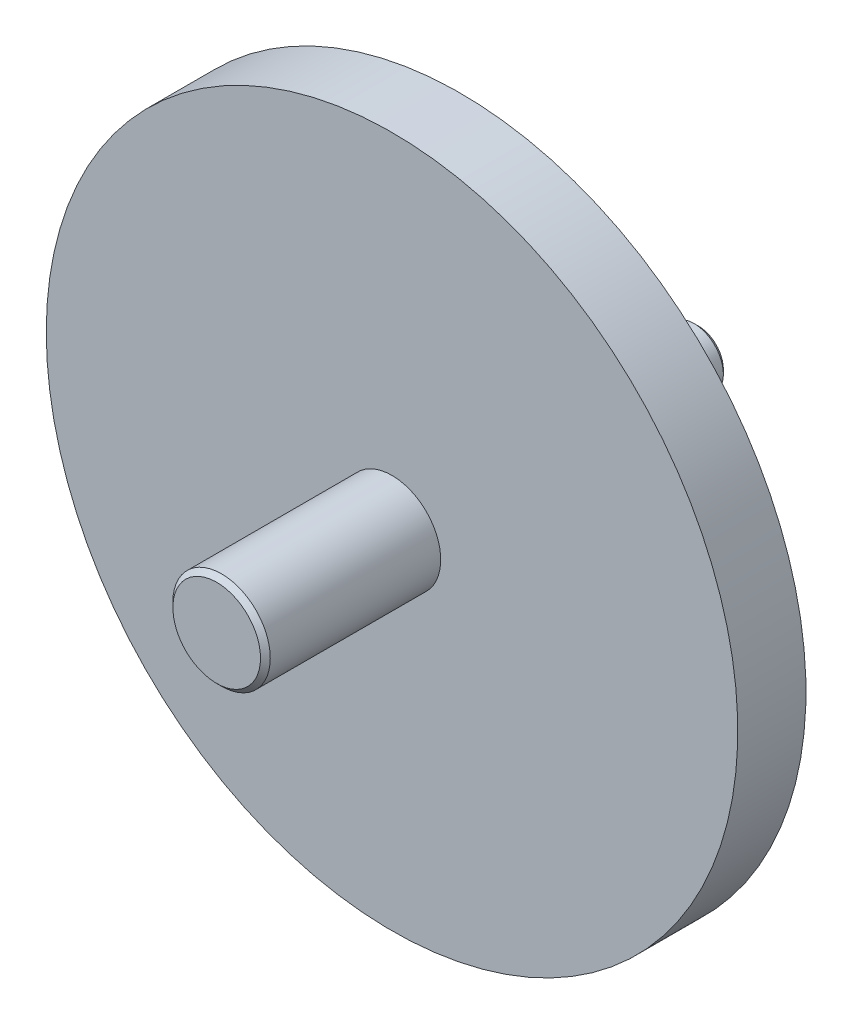
ISO-10303-21;
HEADER;
FILE_DESCRIPTION(('STEP AP214'),'2;1');
FILE_NAME('part.step','',(''),(''),'','','');
FILE_SCHEMA(('AUTOMOTIVE_DESIGN { 1 0 10303 214 1 1 1 1 }'));
ENDSEC;
DATA;
#1=APPLICATION_CONTEXT('core data for automotive mechanical design processes');
#2=APPLICATION_PROTOCOL_DEFINITION('international standard','automotive_design',2000,#1);
#3=PRODUCT_CONTEXT('',#1,'mechanical');
#4=PRODUCT('Part','Part','',(#3));
#5=PRODUCT_RELATED_PRODUCT_CATEGORY('part','',(#4));
#6=PRODUCT_DEFINITION_FORMATION('','',#4);
#7=PRODUCT_DEFINITION_CONTEXT('part definition',#1,'design');
#8=PRODUCT_DEFINITION('design','',#6,#7);
#9=PRODUCT_DEFINITION_SHAPE('','',#8);
#10=(LENGTH_UNIT() NAMED_UNIT(*) SI_UNIT(.MILLI.,.METRE.));
#11=(NAMED_UNIT(*) PLANE_ANGLE_UNIT() SI_UNIT($,.RADIAN.));
#12=(NAMED_UNIT(*) SI_UNIT($,.STERADIAN.) SOLID_ANGLE_UNIT());
#13=UNCERTAINTY_MEASURE_WITH_UNIT(LENGTH_MEASURE(1.E-05),#10,'distance_accuracy_value','');
#14=(GEOMETRIC_REPRESENTATION_CONTEXT(3) GLOBAL_UNCERTAINTY_ASSIGNED_CONTEXT((#13)) GLOBAL_UNIT_ASSIGNED_CONTEXT((#10,
#11,#12)) REPRESENTATION_CONTEXT('',''));
#15=CARTESIAN_POINT('',(0.,0.,0.));
#16=DIRECTION('',(0.,0.,1.));
#17=DIRECTION('',(1.,0.,0.));
#18=AXIS2_PLACEMENT_3D('',#15,#16,#17);
#19=CARTESIAN_POINT('',(0.,3.,-49.4641016151376));
#20=DIRECTION('',(0.,0.,-1.));
#21=DIRECTION('',(-1.,0.,0.));
#22=AXIS2_PLACEMENT_3D('',#19,#20,#21);
#23=PLANE('',#22);
#24=CARTESIAN_POINT('',(0.,0.,-49.4641016151376));
#25=DIRECTION('',(0.,0.,-1.));
#26=DIRECTION('',(-1.,0.,0.));
#27=AXIS2_PLACEMENT_3D('',#24,#25,#26);
#28=CIRCLE('',#27,2.55);
#29=CARTESIAN_POINT('',(-2.55,0.,-49.4641016151376));
#30=VERTEX_POINT('',#29);
#31=EDGE_CURVE('E68',#30,#30,#28,.T.);
#32=ORIENTED_EDGE('',*,*,#31,.T.);
#33=EDGE_LOOP('',(#32));
#34=FACE_BOUND('',#33,.T.);
#35=ADVANCED_FACE('F47',(#34),#23,.T.);
#36=CARTESIAN_POINT('',(0.,0.,-49.4641016151376));
#37=DIRECTION('',(0.,0.,-1.));
#38=DIRECTION('',(-1.,0.,0.));
#39=AXIS2_PLACEMENT_3D('',#36,#37,#38);
#40=CYLINDRICAL_SURFACE('',#39,3.);
#41=CARTESIAN_POINT('',(0.,0.,-49.0141016151376));
#42=DIRECTION('',(0.,0.,-1.));
#43=DIRECTION('',(-1.,0.,0.));
#44=AXIS2_PLACEMENT_3D('',#41,#42,#43);
#45=CIRCLE('',#44,3.);
#46=CARTESIAN_POINT('',(-3.,0.,-49.0141016151376));
#47=VERTEX_POINT('',#46);
#48=EDGE_CURVE('E62',#47,#47,#45,.F.);
#49=ORIENTED_EDGE('',*,*,#48,.T.);
#50=EDGE_LOOP('',(#49));
#51=FACE_BOUND('',#50,.T.);
#52=CARTESIAN_POINT('',(0.,0.,-40.4641016151376));
#53=DIRECTION('',(0.,0.,-1.));
#54=DIRECTION('',(-1.,0.,0.));
#55=AXIS2_PLACEMENT_3D('',#52,#53,#54);
#56=CIRCLE('',#55,3.);
#57=CARTESIAN_POINT('',(-3.,0.,-40.4641016151376));
#58=VERTEX_POINT('',#57);
#59=EDGE_CURVE('E74',#58,#58,#56,.T.);
#60=ORIENTED_EDGE('',*,*,#59,.T.);
#61=EDGE_LOOP('',(#60));
#62=FACE_BOUND('',#61,.T.);
#63=ADVANCED_FACE('F120',(#51,#62),#40,.T.);
#64=CARTESIAN_POINT('',(0.,0.,-40.4641016151376));
#65=DIRECTION('',(0.,0.,1.));
#66=DIRECTION('',(1.,0.,0.));
#67=AXIS2_PLACEMENT_3D('',#64,#65,#66);
#68=CONICAL_SURFACE('',#67,3.,0.261799387799153);
#69=CARTESIAN_POINT('',(0.,0.,-33.));
#70=DIRECTION('',(0.,0.,-1.));
#71=DIRECTION('',(-1.,0.,0.));
#72=AXIS2_PLACEMENT_3D('',#69,#70,#71);
#73=CIRCLE('',#72,5.);
#74=CARTESIAN_POINT('',(-5.,0.,-33.));
#75=VERTEX_POINT('',#74);
#76=EDGE_CURVE('E78',#75,#75,#73,.T.);
#77=ORIENTED_EDGE('',*,*,#76,.T.);
#78=EDGE_LOOP('',(#77));
#79=FACE_BOUND('',#78,.T.);
#80=ORIENTED_EDGE('',*,*,#59,.F.);
#81=EDGE_LOOP('',(#80));
#82=FACE_BOUND('',#81,.T.);
#83=ADVANCED_FACE('F126',(#79,#82),#68,.T.);
#84=CARTESIAN_POINT('',(0.,0.,-49.4641016151376));
#85=DIRECTION('',(0.,0.,-1.));
#86=DIRECTION('',(-1.,0.,0.));
#87=AXIS2_PLACEMENT_3D('',#84,#85,#86);
#88=CYLINDRICAL_SURFACE('',#87,5.);
#89=CARTESIAN_POINT('',(0.,0.,-26.6));
#90=DIRECTION('',(0.,0.,-1.));
#91=DIRECTION('',(-1.,0.,0.));
#92=AXIS2_PLACEMENT_3D('',#89,#90,#91);
#93=CIRCLE('',#92,5.);
#94=CARTESIAN_POINT('',(-5.,0.,-26.6));
#95=VERTEX_POINT('',#94);
#96=EDGE_CURVE('E82',#95,#95,#93,.T.);
#97=ORIENTED_EDGE('',*,*,#96,.T.);
#98=EDGE_LOOP('',(#97));
#99=FACE_BOUND('',#98,.T.);
#100=ORIENTED_EDGE('',*,*,#76,.F.);
#101=EDGE_LOOP('',(#100));
#102=FACE_BOUND('',#101,.T.);
#103=ADVANCED_FACE('F146',(#99,#102),#88,.T.);
#104=CARTESIAN_POINT('',(0.,0.,-25.8));
#105=DIRECTION('',(0.,0.,-1.));
#106=DIRECTION('',(-1.,0.,0.));
#107=AXIS2_PLACEMENT_3D('',#104,#105,#106);
#108=TOROIDAL_SURFACE('',#107,5.,0.8);
#109=CARTESIAN_POINT('',(0.,0.,-25.));
#110=DIRECTION('',(0.,0.,-1.));
#111=DIRECTION('',(-1.,0.,0.));
#112=AXIS2_PLACEMENT_3D('',#109,#110,#111);
#113=CIRCLE('',#112,5.);
#114=CARTESIAN_POINT('',(-5.,0.,-25.));
#115=VERTEX_POINT('',#114);
#116=EDGE_CURVE('E86',#115,#115,#113,.T.);
#117=ORIENTED_EDGE('',*,*,#116,.T.);
#118=EDGE_LOOP('',(#117));
#119=FACE_BOUND('',#118,.T.);
#120=ORIENTED_EDGE('',*,*,#96,.F.);
#121=EDGE_LOOP('',(#120));
#122=FACE_BOUND('',#121,.T.);
#123=ADVANCED_FACE('F151',(#119,#122),#108,.F.);
#124=CARTESIAN_POINT('',(0.,35.5,-25.));
#125=DIRECTION('',(0.,0.,-1.));
#126=DIRECTION('',(-1.,0.,0.));
#127=AXIS2_PLACEMENT_3D('',#124,#125,#126);
#128=PLANE('',#127);
#129=CARTESIAN_POINT('',(0.,0.,-25.));
#130=DIRECTION('',(0.,0.,-1.));
#131=DIRECTION('',(-1.,0.,0.));
#132=AXIS2_PLACEMENT_3D('',#129,#130,#131);
#133=CIRCLE('',#132,35.5);
#134=CARTESIAN_POINT('',(-35.5,0.,-25.));
#135=VERTEX_POINT('',#134);
#136=EDGE_CURVE('E90',#135,#135,#133,.T.);
#137=ORIENTED_EDGE('',*,*,#136,.T.);
#138=EDGE_LOOP('',(#137));
#139=FACE_BOUND('',#138,.T.);
#140=ORIENTED_EDGE('',*,*,#116,.F.);
#141=EDGE_LOOP('',(#140));
#142=FACE_BOUND('',#141,.T.);
#143=ADVANCED_FACE('F157',(#139,#142),#128,.T.);
#144=CARTESIAN_POINT('',(0.,0.,-49.4641016151376));
#145=DIRECTION('',(0.,0.,-1.));
#146=DIRECTION('',(-1.,0.,0.));
#147=AXIS2_PLACEMENT_3D('',#144,#145,#146);
#148=CYLINDRICAL_SURFACE('',#147,35.5);
#149=CARTESIAN_POINT('',(0.,0.,-18.));
#150=DIRECTION('',(0.,0.,-1.));
#151=DIRECTION('',(-1.,0.,0.));
#152=AXIS2_PLACEMENT_3D('',#149,#150,#151);
#153=CIRCLE('',#152,35.5);
#154=CARTESIAN_POINT('',(-35.5,0.,-18.));
#155=VERTEX_POINT('',#154);
#156=EDGE_CURVE('E94',#155,#155,#153,.T.);
#157=ORIENTED_EDGE('',*,*,#156,.T.);
#158=EDGE_LOOP('',(#157));
#159=FACE_BOUND('',#158,.T.);
#160=ORIENTED_EDGE('',*,*,#136,.F.);
#161=EDGE_LOOP('',(#160));
#162=FACE_BOUND('',#161,.T.);
#163=ADVANCED_FACE('F117',(#159,#162),#148,.T.);
#164=CARTESIAN_POINT('',(0.,4.99999999999999,-18.));
#165=DIRECTION('',(0.,0.,1.));
#166=DIRECTION('',(1.,0.,0.));
#167=AXIS2_PLACEMENT_3D('',#164,#165,#166);
#168=PLANE('',#167);
#169=CARTESIAN_POINT('',(0.,0.,-18.));
#170=DIRECTION('',(0.,0.,-1.));
#171=DIRECTION('',(-1.,0.,0.));
#172=AXIS2_PLACEMENT_3D('',#169,#170,#171);
#173=CIRCLE('',#172,4.99999999999999);
#174=CARTESIAN_POINT('',(-4.99999999999999,0.,-18.));
#175=VERTEX_POINT('',#174);
#176=EDGE_CURVE('E98',#175,#175,#173,.T.);
#177=ORIENTED_EDGE('',*,*,#176,.T.);
#178=EDGE_LOOP('',(#177));
#179=FACE_BOUND('',#178,.T.);
#180=ORIENTED_EDGE('',*,*,#156,.F.);
#181=EDGE_LOOP('',(#180));
#182=FACE_BOUND('',#181,.T.);
#183=ADVANCED_FACE('F104',(#179,#182),#168,.T.);
#184=CARTESIAN_POINT('',(0.,0.,-49.4641016151376));
#185=DIRECTION('',(0.,0.,-1.));
#186=DIRECTION('',(-1.,0.,0.));
#187=AXIS2_PLACEMENT_3D('',#184,#185,#186);
#188=CYLINDRICAL_SURFACE('',#187,4.99999999999999);
#189=CARTESIAN_POINT('',(0.,0.,-0.499999999999987));
#190=DIRECTION('',(0.,0.,1.));
#191=DIRECTION('',(1.,0.,0.));
#192=AXIS2_PLACEMENT_3D('',#189,#190,#191);
#193=CIRCLE('',#192,4.99999999999999);
#194=CARTESIAN_POINT('',(4.99999999999999,0.,-0.499999999999987));
#195=VERTEX_POINT('',#194);
#196=EDGE_CURVE('E56',#195,#195,#193,.F.);
#197=ORIENTED_EDGE('',*,*,#196,.T.);
#198=EDGE_LOOP('',(#197));
#199=FACE_BOUND('',#198,.T.);
#200=ORIENTED_EDGE('',*,*,#176,.F.);
#201=EDGE_LOOP('',(#200));
#202=FACE_BOUND('',#201,.T.);
#203=ADVANCED_FACE('F107',(#199,#202),#188,.T.);
#204=CARTESIAN_POINT('',(0.,0.,0.));
#205=DIRECTION('',(0.,0.,1.));
#206=DIRECTION('',(1.,0.,0.));
#207=AXIS2_PLACEMENT_3D('',#204,#205,#206);
#208=PLANE('',#207);
#209=CARTESIAN_POINT('',(0.,0.,0.));
#210=DIRECTION('',(0.,0.,1.));
#211=DIRECTION('',(1.,0.,0.));
#212=AXIS2_PLACEMENT_3D('',#209,#210,#211);
#213=CIRCLE('',#212,4.50000000000002);
#214=CARTESIAN_POINT('',(4.50000000000002,0.,0.));
#215=VERTEX_POINT('',#214);
#216=EDGE_CURVE('E10',#215,#215,#213,.T.);
#217=ORIENTED_EDGE('',*,*,#216,.T.);
#218=EDGE_LOOP('',(#217));
#219=FACE_BOUND('',#218,.T.);
#220=ADVANCED_FACE('F109',(#219),#208,.T.);
#221=CARTESIAN_POINT('',(0.,0.,-49.4641016151376));
#222=DIRECTION('',(0.,0.,1.));
#223=DIRECTION('',(1.,0.,0.));
#224=AXIS2_PLACEMENT_3D('',#221,#222,#223);
#225=CONICAL_SURFACE('',#224,2.55,0.785398163397453);
#226=ORIENTED_EDGE('',*,*,#48,.F.);
#227=EDGE_LOOP('',(#226));
#228=FACE_BOUND('',#227,.T.);
#229=ORIENTED_EDGE('',*,*,#31,.F.);
#230=EDGE_LOOP('',(#229));
#231=FACE_BOUND('',#230,.T.);
#232=ADVANCED_FACE('F115',(#228,#231),#225,.T.);
#233=CARTESIAN_POINT('',(0.,0.,-0.499999999999987));
#234=DIRECTION('',(0.,0.,-1.));
#235=DIRECTION('',(-1.,0.,0.));
#236=AXIS2_PLACEMENT_3D('',#233,#234,#235);
#237=CONICAL_SURFACE('',#236,4.99999999999999,0.785398163397439);
#238=ORIENTED_EDGE('',*,*,#216,.F.);
#239=EDGE_LOOP('',(#238));
#240=FACE_BOUND('',#239,.T.);
#241=ORIENTED_EDGE('',*,*,#196,.F.);
#242=EDGE_LOOP('',(#241));
#243=FACE_BOUND('',#242,.T.);
#244=ADVANCED_FACE('F50',(#240,#243),#237,.T.);
#245=CLOSED_SHELL('',(#35,#63,#83,#103,#123,#143,#163,#183,#203,#220,#232,#244));
#246=MANIFOLD_SOLID_BREP('B2',#245);
#247=ADVANCED_BREP_SHAPE_REPRESENTATION('',(#18,#246),#14);
#248=SHAPE_DEFINITION_REPRESENTATION(#9,#247);
ENDSEC;
END-ISO-10303-21;
